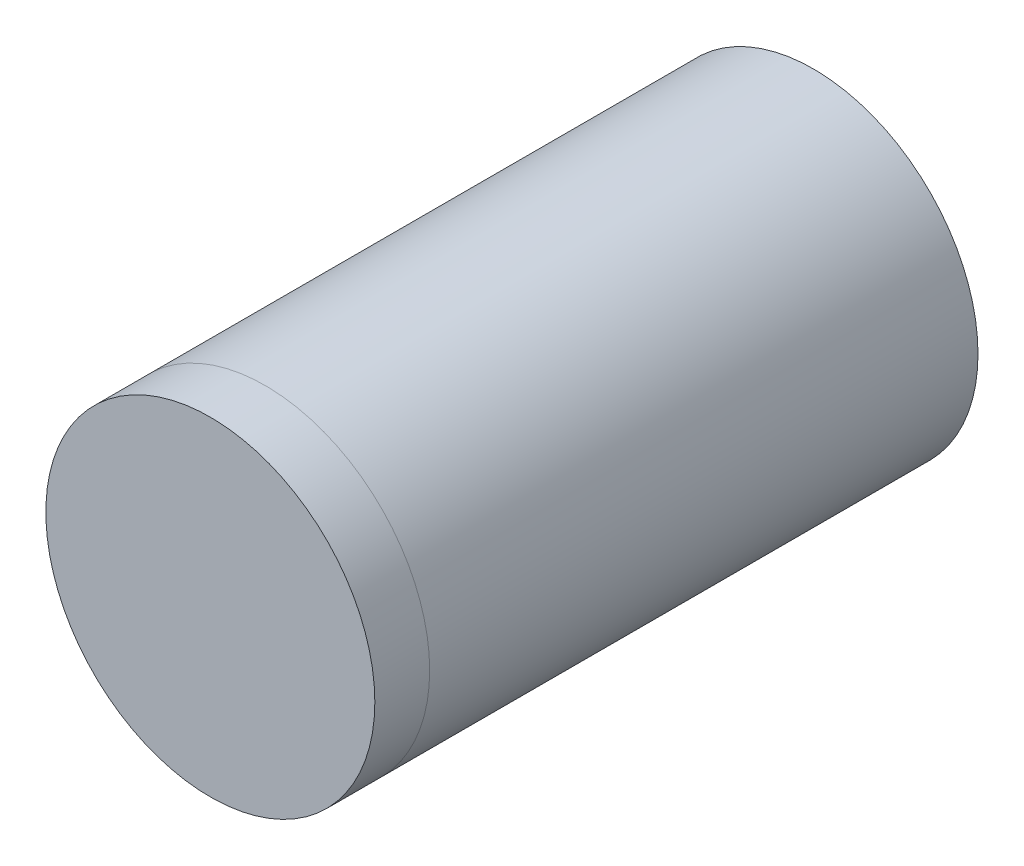
ISO-10303-21;
HEADER;
FILE_DESCRIPTION(('STEP AP214'),'2;1');
FILE_NAME('part.step','',(''),(''),'','','');
FILE_SCHEMA(('AUTOMOTIVE_DESIGN { 1 0 10303 214 1 1 1 1 }'));
ENDSEC;
DATA;
#1=APPLICATION_CONTEXT('core data for automotive mechanical design processes');
#2=APPLICATION_PROTOCOL_DEFINITION('international standard','automotive_design',2000,#1);
#3=PRODUCT_CONTEXT('',#1,'mechanical');
#4=PRODUCT('Part','Part','',(#3));
#5=PRODUCT_RELATED_PRODUCT_CATEGORY('part','',(#4));
#6=PRODUCT_DEFINITION_FORMATION('','',#4);
#7=PRODUCT_DEFINITION_CONTEXT('part definition',#1,'design');
#8=PRODUCT_DEFINITION('design','',#6,#7);
#9=PRODUCT_DEFINITION_SHAPE('','',#8);
#10=(LENGTH_UNIT() NAMED_UNIT(*) SI_UNIT(.MILLI.,.METRE.));
#11=(NAMED_UNIT(*) PLANE_ANGLE_UNIT() SI_UNIT($,.RADIAN.));
#12=(NAMED_UNIT(*) SI_UNIT($,.STERADIAN.) SOLID_ANGLE_UNIT());
#13=UNCERTAINTY_MEASURE_WITH_UNIT(LENGTH_MEASURE(1.E-05),#10,'distance_accuracy_value','');
#14=(GEOMETRIC_REPRESENTATION_CONTEXT(3) GLOBAL_UNCERTAINTY_ASSIGNED_CONTEXT((#13)) GLOBAL_UNIT_ASSIGNED_CONTEXT((#10,
#11,#12)) REPRESENTATION_CONTEXT('',''));
#15=CARTESIAN_POINT('',(0.,0.,0.));
#16=DIRECTION('',(0.,0.,1.));
#17=DIRECTION('',(1.,0.,0.));
#18=AXIS2_PLACEMENT_3D('',#15,#16,#17);
#19=CARTESIAN_POINT('',(0.,0.,33.));
#20=DIRECTION('',(0.,0.,-1.));
#21=DIRECTION('',(-1.,0.,0.));
#22=AXIS2_PLACEMENT_3D('',#19,#20,#21);
#23=CYLINDRICAL_SURFACE('',#22,9.);
#24=CARTESIAN_POINT('',(0.,0.,33.));
#25=DIRECTION('',(0.,0.,1.));
#26=DIRECTION('',(1.,0.,0.));
#27=AXIS2_PLACEMENT_3D('',#24,#25,#26);
#28=CIRCLE('',#27,9.);
#29=CARTESIAN_POINT('',(9.,0.,33.));
#30=VERTEX_POINT('',#29);
#31=EDGE_CURVE('E11',#30,#30,#28,.T.);
#32=ORIENTED_EDGE('',*,*,#31,.F.);
#33=EDGE_LOOP('',(#32));
#34=FACE_BOUND('',#33,.T.);
#35=CARTESIAN_POINT('',(0.,0.,30.));
#36=DIRECTION('',(0.,0.,1.));
#37=DIRECTION('',(1.,0.,0.));
#38=AXIS2_PLACEMENT_3D('',#35,#36,#37);
#39=CIRCLE('',#38,9.);
#40=CARTESIAN_POINT('',(9.,0.,30.));
#41=VERTEX_POINT('',#40);
#42=EDGE_CURVE('E54',#41,#41,#39,.T.);
#43=ORIENTED_EDGE('',*,*,#42,.T.);
#44=EDGE_LOOP('',(#43));
#45=FACE_BOUND('',#44,.T.);
#46=ADVANCED_FACE('F51',(#34,#45),#23,.T.);
#47=CARTESIAN_POINT('',(0.,0.,33.));
#48=DIRECTION('',(0.,0.,1.));
#49=DIRECTION('',(1.,0.,0.));
#50=AXIS2_PLACEMENT_3D('',#47,#48,#49);
#51=PLANE('',#50);
#52=ORIENTED_EDGE('',*,*,#31,.T.);
#53=EDGE_LOOP('',(#52));
#54=FACE_BOUND('',#53,.T.);
#55=ADVANCED_FACE('F66',(#54),#51,.T.);
#56=CARTESIAN_POINT('',(0.,0.,30.));
#57=DIRECTION('',(0.,0.,1.));
#58=DIRECTION('',(1.,0.,0.));
#59=AXIS2_PLACEMENT_3D('',#56,#57,#58);
#60=PLANE('',#59);
#61=ORIENTED_EDGE('',*,*,#42,.F.);
#62=EDGE_LOOP('',(#61));
#63=FACE_BOUND('',#62,.T.);
#64=ADVANCED_FACE('F64',(#63),#60,.F.);
#65=CLOSED_SHELL('',(#46,#55,#64));
#66=MANIFOLD_SOLID_BREP('B2',#65);
#67=CARTESIAN_POINT('',(0.,0.,30.));
#68=DIRECTION('',(0.,0.,-1.));
#69=DIRECTION('',(-1.,0.,0.));
#70=AXIS2_PLACEMENT_3D('',#67,#68,#69);
#71=CYLINDRICAL_SURFACE('',#70,9.);
#72=CARTESIAN_POINT('',(0.,0.,30.));
#73=DIRECTION('',(0.,0.,1.));
#74=DIRECTION('',(1.,0.,0.));
#75=AXIS2_PLACEMENT_3D('',#72,#73,#74);
#76=CIRCLE('',#75,9.);
#77=CARTESIAN_POINT('',(9.,0.,30.));
#78=VERTEX_POINT('',#77);
#79=EDGE_CURVE('E50',#78,#78,#76,.T.);
#80=ORIENTED_EDGE('',*,*,#79,.F.);
#81=EDGE_LOOP('',(#80));
#82=FACE_BOUND('',#81,.T.);
#83=CARTESIAN_POINT('',(0.,0.,0.));
#84=DIRECTION('',(0.,0.,1.));
#85=DIRECTION('',(1.,0.,0.));
#86=AXIS2_PLACEMENT_3D('',#83,#84,#85);
#87=CIRCLE('',#86,9.);
#88=CARTESIAN_POINT('',(9.,0.,0.));
#89=VERTEX_POINT('',#88);
#90=EDGE_CURVE('E101',#89,#89,#87,.T.);
#91=ORIENTED_EDGE('',*,*,#90,.T.);
#92=EDGE_LOOP('',(#91));
#93=FACE_BOUND('',#92,.T.);
#94=ADVANCED_FACE('F98',(#82,#93),#71,.T.);
#95=CARTESIAN_POINT('',(0.,0.,30.));
#96=DIRECTION('',(0.,0.,1.));
#97=DIRECTION('',(1.,0.,0.));
#98=AXIS2_PLACEMENT_3D('',#95,#96,#97);
#99=PLANE('',#98);
#100=ORIENTED_EDGE('',*,*,#79,.T.);
#101=EDGE_LOOP('',(#100));
#102=FACE_BOUND('',#101,.T.);
#103=ADVANCED_FACE('F115',(#102),#99,.T.);
#104=CARTESIAN_POINT('',(0.,0.,0.));
#105=DIRECTION('',(0.,0.,1.));
#106=DIRECTION('',(1.,0.,0.));
#107=AXIS2_PLACEMENT_3D('',#104,#105,#106);
#108=PLANE('',#107);
#109=ORIENTED_EDGE('',*,*,#90,.F.);
#110=EDGE_LOOP('',(#109));
#111=FACE_BOUND('',#110,.T.);
#112=ADVANCED_FACE('F113',(#111),#108,.F.);
#113=CLOSED_SHELL('',(#94,#103,#112));
#114=MANIFOLD_SOLID_BREP('B6',#113);
#115=ADVANCED_BREP_SHAPE_REPRESENTATION('',(#18,#66,#114),#14);
#116=SHAPE_DEFINITION_REPRESENTATION(#9,#115);
ENDSEC;
END-ISO-10303-21;
